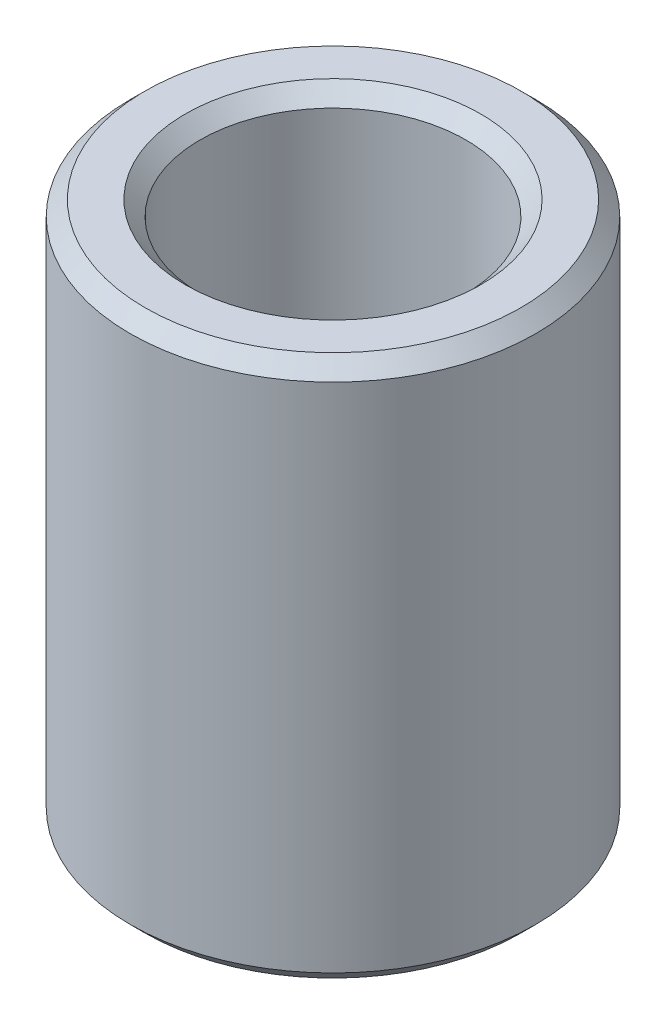
ISO-10303-21;
HEADER;
FILE_DESCRIPTION(('STEP AP214'),'2;1');
FILE_NAME('part.step','',(''),(''),'','','');
FILE_SCHEMA(('AUTOMOTIVE_DESIGN { 1 0 10303 214 1 1 1 1 }'));
ENDSEC;
DATA;
#1=APPLICATION_CONTEXT('core data for automotive mechanical design processes');
#2=APPLICATION_PROTOCOL_DEFINITION('international standard','automotive_design',2000,#1);
#3=PRODUCT_CONTEXT('',#1,'mechanical');
#4=PRODUCT('Part','Part','',(#3));
#5=PRODUCT_RELATED_PRODUCT_CATEGORY('part','',(#4));
#6=PRODUCT_DEFINITION_FORMATION('','',#4);
#7=PRODUCT_DEFINITION_CONTEXT('part definition',#1,'design');
#8=PRODUCT_DEFINITION('design','',#6,#7);
#9=PRODUCT_DEFINITION_SHAPE('','',#8);
#10=(LENGTH_UNIT() NAMED_UNIT(*) SI_UNIT(.MILLI.,.METRE.));
#11=(NAMED_UNIT(*) PLANE_ANGLE_UNIT() SI_UNIT($,.RADIAN.));
#12=(NAMED_UNIT(*) SI_UNIT($,.STERADIAN.) SOLID_ANGLE_UNIT());
#13=UNCERTAINTY_MEASURE_WITH_UNIT(LENGTH_MEASURE(1.E-05),#10,'distance_accuracy_value','');
#14=(GEOMETRIC_REPRESENTATION_CONTEXT(3) GLOBAL_UNCERTAINTY_ASSIGNED_CONTEXT((#13)) GLOBAL_UNIT_ASSIGNED_CONTEXT((#10,
#11,#12)) REPRESENTATION_CONTEXT('',''));
#15=CARTESIAN_POINT('',(0.,0.,0.));
#16=DIRECTION('',(0.,0.,1.));
#17=DIRECTION('',(1.,0.,0.));
#18=AXIS2_PLACEMENT_3D('',#15,#16,#17);
#19=CARTESIAN_POINT('',(0.,100.153044210662,0.));
#20=DIRECTION('',(0.,-1.,0.));
#21=DIRECTION('',(0.,0.,-1.));
#22=AXIS2_PLACEMENT_3D('',#19,#20,#21);
#23=CYLINDRICAL_SURFACE('',#22,37.5);
#24=CARTESIAN_POINT('',(0.,2.76393185633445,0.));
#25=DIRECTION('',(0.,1.,0.));
#26=DIRECTION('',(0.,0.,1.));
#27=AXIS2_PLACEMENT_3D('',#24,#25,#26);
#28=CIRCLE('',#27,37.5);
#29=CARTESIAN_POINT('',(0.,2.76393185633445,37.5));
#30=VERTEX_POINT('',#29);
#31=EDGE_CURVE('E10',#30,#30,#28,.T.);
#32=ORIENTED_EDGE('',*,*,#31,.T.);
#33=EDGE_LOOP('',(#32));
#34=FACE_BOUND('',#33,.T.);
#35=CARTESIAN_POINT('',(0.,97.3891123543278,0.));
#36=DIRECTION('',(0.,1.,0.));
#37=DIRECTION('',(0.,0.,1.));
#38=AXIS2_PLACEMENT_3D('',#35,#36,#37);
#39=CIRCLE('',#38,37.5);
#40=CARTESIAN_POINT('',(0.,97.3891123543278,37.5));
#41=VERTEX_POINT('',#40);
#42=EDGE_CURVE('E50',#41,#41,#39,.F.);
#43=ORIENTED_EDGE('',*,*,#42,.T.);
#44=EDGE_LOOP('',(#43));
#45=FACE_BOUND('',#44,.T.);
#46=ADVANCED_FACE('F39',(#34,#45),#23,.T.);
#47=CARTESIAN_POINT('',(0.,100.153044210662,0.));
#48=DIRECTION('',(0.,1.,0.));
#49=DIRECTION('',(0.,0.,1.));
#50=AXIS2_PLACEMENT_3D('',#47,#48,#49);
#51=PLANE('',#50);
#52=CARTESIAN_POINT('',(0.,100.153044210662,0.));
#53=DIRECTION('',(0.,1.,0.));
#54=DIRECTION('',(0.,0.,1.));
#55=AXIS2_PLACEMENT_3D('',#52,#53,#54);
#56=CIRCLE('',#55,27.34560140733);
#57=CARTESIAN_POINT('',(0.,100.153044210662,27.34560140733));
#58=VERTEX_POINT('',#57);
#59=EDGE_CURVE('E58',#58,#58,#56,.F.);
#60=ORIENTED_EDGE('',*,*,#59,.T.);
#61=EDGE_LOOP('',(#60));
#62=FACE_BOUND('',#61,.T.);
#63=CARTESIAN_POINT('',(0.,100.153044210662,0.));
#64=DIRECTION('',(0.,1.,0.));
#65=DIRECTION('',(0.,0.,1.));
#66=AXIS2_PLACEMENT_3D('',#63,#64,#65);
#67=CIRCLE('',#66,34.7360681436655);
#68=CARTESIAN_POINT('',(0.,100.153044210662,34.7360681436655));
#69=VERTEX_POINT('',#68);
#70=EDGE_CURVE('E61',#69,#69,#67,.T.);
#71=ORIENTED_EDGE('',*,*,#70,.T.);
#72=EDGE_LOOP('',(#71));
#73=FACE_BOUND('',#72,.T.);
#74=ADVANCED_FACE('F88',(#62,#73),#51,.T.);
#75=CARTESIAN_POINT('',(0.,0.,0.));
#76=DIRECTION('',(0.,1.,0.));
#77=DIRECTION('',(0.,0.,1.));
#78=AXIS2_PLACEMENT_3D('',#75,#76,#77);
#79=PLANE('',#78);
#80=CARTESIAN_POINT('',(0.,0.,0.));
#81=DIRECTION('',(0.,1.,0.));
#82=DIRECTION('',(0.,0.,1.));
#83=AXIS2_PLACEMENT_3D('',#80,#81,#82);
#84=CIRCLE('',#83,27.34560140733);
#85=CARTESIAN_POINT('',(0.,0.,27.34560140733));
#86=VERTEX_POINT('',#85);
#87=EDGE_CURVE('E51',#86,#86,#84,.T.);
#88=ORIENTED_EDGE('',*,*,#87,.T.);
#89=EDGE_LOOP('',(#88));
#90=FACE_BOUND('',#89,.T.);
#91=CARTESIAN_POINT('',(0.,0.,0.));
#92=DIRECTION('',(0.,1.,0.));
#93=DIRECTION('',(0.,0.,1.));
#94=AXIS2_PLACEMENT_3D('',#91,#92,#93);
#95=CIRCLE('',#94,34.7360681436655);
#96=CARTESIAN_POINT('',(0.,0.,34.7360681436655));
#97=VERTEX_POINT('',#96);
#98=EDGE_CURVE('E54',#97,#97,#95,.F.);
#99=ORIENTED_EDGE('',*,*,#98,.T.);
#100=EDGE_LOOP('',(#99));
#101=FACE_BOUND('',#100,.T.);
#102=ADVANCED_FACE('F83',(#90,#101),#79,.F.);
#103=CARTESIAN_POINT('',(0.,100.153044210662,0.));
#104=DIRECTION('',(0.,-1.,0.));
#105=DIRECTION('',(0.,0.,-1.));
#106=AXIS2_PLACEMENT_3D('',#103,#104,#105);
#107=CYLINDRICAL_SURFACE('',#106,24.5816695509955);
#108=CARTESIAN_POINT('',(0.,97.3891123543278,0.));
#109=DIRECTION('',(0.,1.,0.));
#110=DIRECTION('',(0.,0.,1.));
#111=AXIS2_PLACEMENT_3D('',#108,#109,#110);
#112=CIRCLE('',#111,24.5816695509955);
#113=CARTESIAN_POINT('',(0.,97.3891123543278,24.5816695509955));
#114=VERTEX_POINT('',#113);
#115=EDGE_CURVE('E67',#114,#114,#112,.T.);
#116=ORIENTED_EDGE('',*,*,#115,.T.);
#117=EDGE_LOOP('',(#116));
#118=FACE_BOUND('',#117,.T.);
#119=CARTESIAN_POINT('',(0.,2.76393185633446,0.));
#120=DIRECTION('',(0.,1.,0.));
#121=DIRECTION('',(0.,0.,1.));
#122=AXIS2_PLACEMENT_3D('',#119,#120,#121);
#123=CIRCLE('',#122,24.5816695509955);
#124=CARTESIAN_POINT('',(0.,2.76393185633446,24.5816695509955));
#125=VERTEX_POINT('',#124);
#126=EDGE_CURVE('E69',#125,#125,#123,.F.);
#127=ORIENTED_EDGE('',*,*,#126,.T.);
#128=EDGE_LOOP('',(#127));
#129=FACE_BOUND('',#128,.T.);
#130=ADVANCED_FACE('F71',(#118,#129),#107,.F.);
#131=CARTESIAN_POINT('',(0.,97.3891123543278,0.));
#132=DIRECTION('',(0.,1.,0.));
#133=DIRECTION('',(0.,0.,1.));
#134=AXIS2_PLACEMENT_3D('',#131,#132,#133);
#135=CONICAL_SURFACE('',#134,24.5816695509955,0.785398163397453);
#136=ORIENTED_EDGE('',*,*,#59,.F.);
#137=EDGE_LOOP('',(#136));
#138=FACE_BOUND('',#137,.T.);
#139=ORIENTED_EDGE('',*,*,#115,.F.);
#140=EDGE_LOOP('',(#139));
#141=FACE_BOUND('',#140,.T.);
#142=ADVANCED_FACE('F77',(#138,#141),#135,.F.);
#143=CARTESIAN_POINT('',(0.,0.,0.));
#144=DIRECTION('',(0.,-1.,0.));
#145=DIRECTION('',(0.,0.,-1.));
#146=AXIS2_PLACEMENT_3D('',#143,#144,#145);
#147=CONICAL_SURFACE('',#146,27.34560140733,0.785398163397445);
#148=ORIENTED_EDGE('',*,*,#126,.F.);
#149=EDGE_LOOP('',(#148));
#150=FACE_BOUND('',#149,.T.);
#151=ORIENTED_EDGE('',*,*,#87,.F.);
#152=EDGE_LOOP('',(#151));
#153=FACE_BOUND('',#152,.T.);
#154=ADVANCED_FACE('F73',(#150,#153),#147,.F.);
#155=CARTESIAN_POINT('',(0.,2.76393185633445,0.));
#156=DIRECTION('',(0.,1.,0.));
#157=DIRECTION('',(0.,0.,1.));
#158=AXIS2_PLACEMENT_3D('',#155,#156,#157);
#159=CONICAL_SURFACE('',#158,37.5,0.785398163397453);
#160=ORIENTED_EDGE('',*,*,#98,.F.);
#161=EDGE_LOOP('',(#160));
#162=FACE_BOUND('',#161,.T.);
#163=ORIENTED_EDGE('',*,*,#31,.F.);
#164=EDGE_LOOP('',(#163));
#165=FACE_BOUND('',#164,.T.);
#166=ADVANCED_FACE('F76',(#162,#165),#159,.T.);
#167=CARTESIAN_POINT('',(0.,100.153044210662,0.));
#168=DIRECTION('',(0.,-1.,0.));
#169=DIRECTION('',(0.,0.,-1.));
#170=AXIS2_PLACEMENT_3D('',#167,#168,#169);
#171=CONICAL_SURFACE('',#170,34.7360681436655,0.785398163397446);
#172=ORIENTED_EDGE('',*,*,#42,.F.);
#173=EDGE_LOOP('',(#172));
#174=FACE_BOUND('',#173,.T.);
#175=ORIENTED_EDGE('',*,*,#70,.F.);
#176=EDGE_LOOP('',(#175));
#177=FACE_BOUND('',#176,.T.);
#178=ADVANCED_FACE('F45',(#174,#177),#171,.T.);
#179=CLOSED_SHELL('',(#46,#74,#102,#130,#142,#154,#166,#178));
#180=MANIFOLD_SOLID_BREP('B2',#179);
#181=ADVANCED_BREP_SHAPE_REPRESENTATION('',(#18,#180),#14);
#182=SHAPE_DEFINITION_REPRESENTATION(#9,#181);
ENDSEC;
END-ISO-10303-21;
